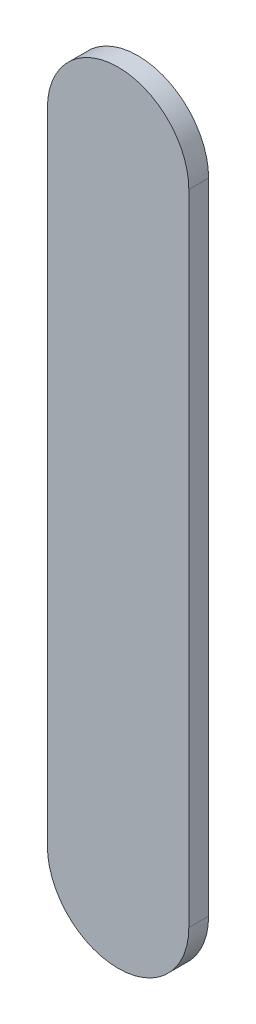
ISO-10303-21;
HEADER;
FILE_DESCRIPTION(('STEP AP214'),'2;1');
FILE_NAME('part.step','',(''),(''),'','','');
FILE_SCHEMA(('AUTOMOTIVE_DESIGN { 1 0 10303 214 1 1 1 1 }'));
ENDSEC;
DATA;
#1=APPLICATION_CONTEXT('core data for automotive mechanical design processes');
#2=APPLICATION_PROTOCOL_DEFINITION('international standard','automotive_design',2000,#1);
#3=PRODUCT_CONTEXT('',#1,'mechanical');
#4=PRODUCT('Part','Part','',(#3));
#5=PRODUCT_RELATED_PRODUCT_CATEGORY('part','',(#4));
#6=PRODUCT_DEFINITION_FORMATION('','',#4);
#7=PRODUCT_DEFINITION_CONTEXT('part definition',#1,'design');
#8=PRODUCT_DEFINITION('design','',#6,#7);
#9=PRODUCT_DEFINITION_SHAPE('','',#8);
#10=(LENGTH_UNIT() NAMED_UNIT(*) SI_UNIT(.MILLI.,.METRE.));
#11=(NAMED_UNIT(*) PLANE_ANGLE_UNIT() SI_UNIT($,.RADIAN.));
#12=(NAMED_UNIT(*) SI_UNIT($,.STERADIAN.) SOLID_ANGLE_UNIT());
#13=UNCERTAINTY_MEASURE_WITH_UNIT(LENGTH_MEASURE(1.E-05),#10,'distance_accuracy_value','');
#14=(GEOMETRIC_REPRESENTATION_CONTEXT(3) GLOBAL_UNCERTAINTY_ASSIGNED_CONTEXT((#13)) GLOBAL_UNIT_ASSIGNED_CONTEXT((#10,
#11,#12)) REPRESENTATION_CONTEXT('',''));
#15=CARTESIAN_POINT('',(0.,0.,0.));
#16=DIRECTION('',(0.,0.,1.));
#17=DIRECTION('',(1.,0.,0.));
#18=AXIS2_PLACEMENT_3D('',#15,#16,#17);
#19=CARTESIAN_POINT('',(89.0180084,97.6129366,0.));
#20=DIRECTION('',(-1.,0.,0.));
#21=DIRECTION('',(0.,1.,0.));
#22=AXIS2_PLACEMENT_3D('',#19,#20,#21);
#23=PLANE('',#22);
#24=DIRECTION('',(0.,1.,0.));
#25=VECTOR('',#24,1.);
#26=CARTESIAN_POINT('',(89.0180084,97.6129366,0.03556));
#27=LINE('',#26,#25);
#28=CARTESIAN_POINT('',(89.0180084,97.6129366,0.03556));
#29=VERTEX_POINT('',#28);
#30=CARTESIAN_POINT('',(89.0180084,98.76100898,0.03556));
#31=VERTEX_POINT('',#30);
#32=EDGE_CURVE('E11',#29,#31,#27,.T.);
#33=ORIENTED_EDGE('',*,*,#32,.F.);
#34=DIRECTION('',(0.,0.,1.));
#35=VECTOR('',#34,1.);
#36=CARTESIAN_POINT('',(89.0180084,97.6129366,0.));
#37=LINE('',#36,#35);
#38=CARTESIAN_POINT('',(89.0180084,97.6129366,0.));
#39=VERTEX_POINT('',#38);
#40=EDGE_CURVE('E24',#39,#29,#37,.T.);
#41=ORIENTED_EDGE('',*,*,#40,.F.);
#42=DIRECTION('',(0.,1.,0.));
#43=VECTOR('',#42,1.);
#44=CARTESIAN_POINT('',(89.0180084,97.6129366,0.));
#45=LINE('',#44,#43);
#46=CARTESIAN_POINT('',(89.0180084,98.76100898,0.));
#47=VERTEX_POINT('',#46);
#48=EDGE_CURVE('E75',#39,#47,#45,.T.);
#49=ORIENTED_EDGE('',*,*,#48,.T.);
#50=DIRECTION('',(0.,0.,1.));
#51=VECTOR('',#50,1.);
#52=CARTESIAN_POINT('',(89.0180084,98.76100898,0.));
#53=LINE('',#52,#51);
#54=EDGE_CURVE('E37',#47,#31,#53,.T.);
#55=ORIENTED_EDGE('',*,*,#54,.T.);
#56=EDGE_LOOP('',(#33,#41,#49,#55));
#57=FACE_BOUND('',#56,.T.);
#58=ADVANCED_FACE('F17',(#57),#23,.F.);
#59=CARTESIAN_POINT('',(88.8910084,98.76100898,0.));
#60=DIRECTION('',(0.,0.,-1.));
#61=DIRECTION('',(1.,0.,0.));
#62=AXIS2_PLACEMENT_3D('',#59,#60,#61);
#63=CYLINDRICAL_SURFACE('',#62,0.126999999999995);
#64=CARTESIAN_POINT('',(88.8910084,98.76100898,0.03556));
#65=DIRECTION('',(0.,0.,1.));
#66=DIRECTION('',(1.,0.,0.));
#67=AXIS2_PLACEMENT_3D('',#64,#65,#66);
#68=CIRCLE('',#67,0.126999999999995);
#69=CARTESIAN_POINT('',(88.7640084,98.76100898,0.03556));
#70=VERTEX_POINT('',#69);
#71=EDGE_CURVE('E83',#31,#70,#68,.T.);
#72=ORIENTED_EDGE('',*,*,#71,.F.);
#73=ORIENTED_EDGE('',*,*,#54,.F.);
#74=CARTESIAN_POINT('',(88.8910084,98.76100898,0.));
#75=DIRECTION('',(0.,0.,1.));
#76=DIRECTION('',(1.,0.,0.));
#77=AXIS2_PLACEMENT_3D('',#74,#75,#76);
#78=CIRCLE('',#77,0.126999999999995);
#79=CARTESIAN_POINT('',(88.7640084,98.76100898,0.));
#80=VERTEX_POINT('',#79);
#81=EDGE_CURVE('E81',#47,#80,#78,.T.);
#82=ORIENTED_EDGE('',*,*,#81,.T.);
#83=DIRECTION('',(0.,0.,1.));
#84=VECTOR('',#83,1.);
#85=CARTESIAN_POINT('',(88.7640084,98.76100898,0.));
#86=LINE('',#85,#84);
#87=EDGE_CURVE('E67',#80,#70,#86,.T.);
#88=ORIENTED_EDGE('',*,*,#87,.T.);
#89=EDGE_LOOP('',(#72,#73,#82,#88));
#90=FACE_BOUND('',#89,.T.);
#91=ADVANCED_FACE('F89',(#90),#63,.T.);
#92=CARTESIAN_POINT('',(88.7640084,98.76100898,0.));
#93=DIRECTION('',(1.,0.,0.));
#94=DIRECTION('',(0.,-1.,0.));
#95=AXIS2_PLACEMENT_3D('',#92,#93,#94);
#96=PLANE('',#95);
#97=DIRECTION('',(0.,-1.,0.));
#98=VECTOR('',#97,1.);
#99=CARTESIAN_POINT('',(88.7640084,98.76100898,0.03556));
#100=LINE('',#99,#98);
#101=CARTESIAN_POINT('',(88.7640084,97.6129366,0.03556));
#102=VERTEX_POINT('',#101);
#103=EDGE_CURVE('E71',#70,#102,#100,.T.);
#104=ORIENTED_EDGE('',*,*,#103,.F.);
#105=ORIENTED_EDGE('',*,*,#87,.F.);
#106=DIRECTION('',(0.,-1.,0.));
#107=VECTOR('',#106,1.);
#108=CARTESIAN_POINT('',(88.7640084,98.76100898,0.));
#109=LINE('',#108,#107);
#110=CARTESIAN_POINT('',(88.7640084,97.6129366,0.));
#111=VERTEX_POINT('',#110);
#112=EDGE_CURVE('E63',#80,#111,#109,.T.);
#113=ORIENTED_EDGE('',*,*,#112,.T.);
#114=DIRECTION('',(0.,0.,1.));
#115=VECTOR('',#114,1.);
#116=CARTESIAN_POINT('',(88.7640084,97.6129366,0.));
#117=LINE('',#116,#115);
#118=EDGE_CURVE('E53',#111,#102,#117,.T.);
#119=ORIENTED_EDGE('',*,*,#118,.T.);
#120=EDGE_LOOP('',(#104,#105,#113,#119));
#121=FACE_BOUND('',#120,.T.);
#122=ADVANCED_FACE('F66',(#121),#96,.F.);
#123=CARTESIAN_POINT('',(88.8910084,97.6129366,0.));
#124=DIRECTION('',(0.,0.,-1.));
#125=DIRECTION('',(-1.,1.11896493820492E-13,0.));
#126=AXIS2_PLACEMENT_3D('',#123,#124,#125);
#127=CYLINDRICAL_SURFACE('',#126,0.126999999999995);
#128=CARTESIAN_POINT('',(88.8910084,97.6129366,0.03556));
#129=DIRECTION('',(0.,0.,1.));
#130=DIRECTION('',(-1.,1.11896493820492E-13,0.));
#131=AXIS2_PLACEMENT_3D('',#128,#129,#130);
#132=CIRCLE('',#131,0.126999999999995);
#133=EDGE_CURVE('E59',#102,#29,#132,.T.);
#134=ORIENTED_EDGE('',*,*,#133,.F.);
#135=ORIENTED_EDGE('',*,*,#118,.F.);
#136=CARTESIAN_POINT('',(88.8910084,97.6129366,0.));
#137=DIRECTION('',(0.,0.,1.));
#138=DIRECTION('',(-1.,1.11896493820492E-13,0.));
#139=AXIS2_PLACEMENT_3D('',#136,#137,#138);
#140=CIRCLE('',#139,0.126999999999995);
#141=EDGE_CURVE('E57',#111,#39,#140,.T.);
#142=ORIENTED_EDGE('',*,*,#141,.T.);
#143=ORIENTED_EDGE('',*,*,#40,.T.);
#144=EDGE_LOOP('',(#134,#135,#142,#143));
#145=FACE_BOUND('',#144,.T.);
#146=ADVANCED_FACE('F55',(#145),#127,.T.);
#147=CARTESIAN_POINT('',(89.0180084,97.6129366,0.));
#148=DIRECTION('',(0.,0.,-1.));
#149=DIRECTION('',(-1.,0.,0.));
#150=AXIS2_PLACEMENT_3D('',#147,#148,#149);
#151=PLANE('',#150);
#152=ORIENTED_EDGE('',*,*,#141,.F.);
#153=ORIENTED_EDGE('',*,*,#112,.F.);
#154=ORIENTED_EDGE('',*,*,#81,.F.);
#155=ORIENTED_EDGE('',*,*,#48,.F.);
#156=EDGE_LOOP('',(#152,#153,#154,#155));
#157=FACE_BOUND('',#156,.T.);
#158=ADVANCED_FACE('F74',(#157),#151,.T.);
#159=CARTESIAN_POINT('',(89.0180084,97.6129366,0.03556));
#160=DIRECTION('',(0.,0.,-1.));
#161=DIRECTION('',(-1.,0.,0.));
#162=AXIS2_PLACEMENT_3D('',#159,#160,#161);
#163=PLANE('',#162);
#164=ORIENTED_EDGE('',*,*,#32,.T.);
#165=ORIENTED_EDGE('',*,*,#71,.T.);
#166=ORIENTED_EDGE('',*,*,#103,.T.);
#167=ORIENTED_EDGE('',*,*,#133,.T.);
#168=EDGE_LOOP('',(#164,#165,#166,#167));
#169=FACE_BOUND('',#168,.T.);
#170=ADVANCED_FACE('F91',(#169),#163,.F.);
#171=CLOSED_SHELL('',(#58,#91,#122,#146,#158,#170));
#172=MANIFOLD_SOLID_BREP('B1',#171);
#173=ADVANCED_BREP_SHAPE_REPRESENTATION('',(#18,#172),#14);
#174=SHAPE_DEFINITION_REPRESENTATION(#9,#173);
ENDSEC;
END-ISO-10303-21;
